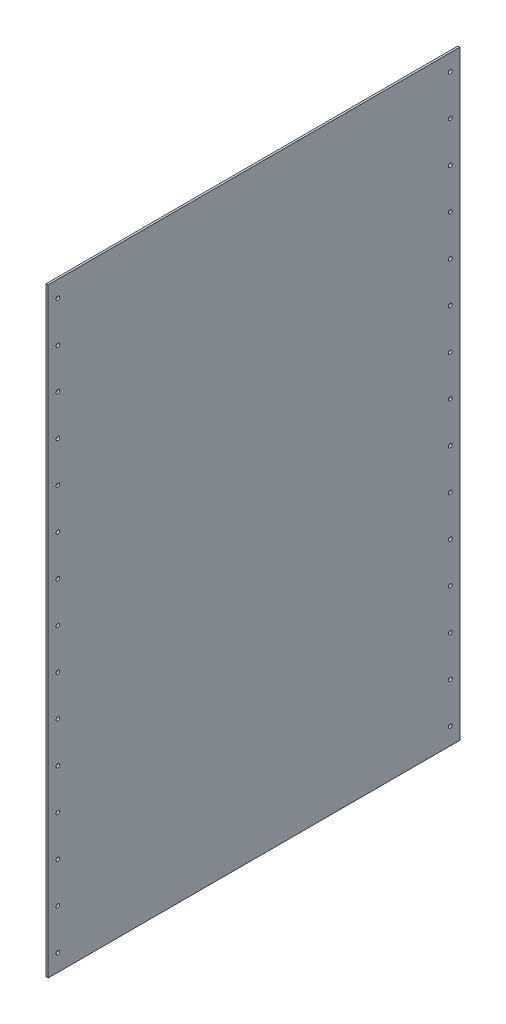
ISO-10303-21;
HEADER;
FILE_DESCRIPTION(('STEP AP214'),'2;1');
FILE_NAME('part.step','',(''),(''),'','','');
FILE_SCHEMA(('AUTOMOTIVE_DESIGN { 1 0 10303 214 1 1 1 1 }'));
ENDSEC;
DATA;
#1=APPLICATION_CONTEXT('core data for automotive mechanical design processes');
#2=APPLICATION_PROTOCOL_DEFINITION('international standard','automotive_design',2000,#1);
#3=PRODUCT_CONTEXT('',#1,'mechanical');
#4=PRODUCT('Part','Part','',(#3));
#5=PRODUCT_RELATED_PRODUCT_CATEGORY('part','',(#4));
#6=PRODUCT_DEFINITION_FORMATION('','',#4);
#7=PRODUCT_DEFINITION_CONTEXT('part definition',#1,'design');
#8=PRODUCT_DEFINITION('design','',#6,#7);
#9=PRODUCT_DEFINITION_SHAPE('','',#8);
#10=(LENGTH_UNIT() NAMED_UNIT(*) SI_UNIT(.MILLI.,.METRE.));
#11=(NAMED_UNIT(*) PLANE_ANGLE_UNIT() SI_UNIT($,.RADIAN.));
#12=(NAMED_UNIT(*) SI_UNIT($,.STERADIAN.) SOLID_ANGLE_UNIT());
#13=UNCERTAINTY_MEASURE_WITH_UNIT(LENGTH_MEASURE(1.E-05),#10,'distance_accuracy_value','');
#14=(GEOMETRIC_REPRESENTATION_CONTEXT(3) GLOBAL_UNCERTAINTY_ASSIGNED_CONTEXT((#13)) GLOBAL_UNIT_ASSIGNED_CONTEXT((#10,
#11,#12)) REPRESENTATION_CONTEXT('',''));
#15=CARTESIAN_POINT('',(0.,0.,0.));
#16=DIRECTION('',(0.,0.,1.));
#17=DIRECTION('',(1.,0.,0.));
#18=AXIS2_PLACEMENT_3D('',#15,#16,#17);
#19=CARTESIAN_POINT('',(3.,0.,0.));
#20=DIRECTION('',(0.,0.,-1.));
#21=DIRECTION('',(-1.,0.,0.));
#22=AXIS2_PLACEMENT_3D('',#19,#20,#21);
#23=PLANE('',#22);
#24=DIRECTION('',(0.,-1.,0.));
#25=VECTOR('',#24,1.);
#26=CARTESIAN_POINT('',(0.,0.,0.));
#27=LINE('',#26,#25);
#28=CARTESIAN_POINT('',(0.,889.,0.));
#29=VERTEX_POINT('',#28);
#30=CARTESIAN_POINT('',(0.,0.,0.));
#31=VERTEX_POINT('',#30);
#32=EDGE_CURVE('E100',#29,#31,#27,.T.);
#33=ORIENTED_EDGE('',*,*,#32,.T.);
#34=DIRECTION('',(-1.,0.,0.));
#35=VECTOR('',#34,1.);
#36=CARTESIAN_POINT('',(3.,0.,0.));
#37=LINE('',#36,#35);
#38=CARTESIAN_POINT('',(3.,0.,0.));
#39=VERTEX_POINT('',#38);
#40=EDGE_CURVE('E11',#39,#31,#37,.T.);
#41=ORIENTED_EDGE('',*,*,#40,.F.);
#42=DIRECTION('',(0.,-1.,0.));
#43=VECTOR('',#42,1.);
#44=CARTESIAN_POINT('',(3.,0.,0.));
#45=LINE('',#44,#43);
#46=CARTESIAN_POINT('',(3.,889.,0.));
#47=VERTEX_POINT('',#46);
#48=EDGE_CURVE('E87',#47,#39,#45,.T.);
#49=ORIENTED_EDGE('',*,*,#48,.F.);
#50=DIRECTION('',(-1.,0.,0.));
#51=VECTOR('',#50,1.);
#52=CARTESIAN_POINT('',(3.,889.,0.));
#53=LINE('',#52,#51);
#54=EDGE_CURVE('E96',#47,#29,#53,.T.);
#55=ORIENTED_EDGE('',*,*,#54,.T.);
#56=EDGE_LOOP('',(#33,#41,#49,#55));
#57=FACE_BOUND('',#56,.T.);
#58=ADVANCED_FACE('F36',(#57),#23,.F.);
#59=CARTESIAN_POINT('',(3.,0.,0.));
#60=DIRECTION('',(0.,1.,0.));
#61=DIRECTION('',(0.,0.,1.));
#62=AXIS2_PLACEMENT_3D('',#59,#60,#61);
#63=PLANE('',#62);
#64=DIRECTION('',(0.,0.,-1.));
#65=VECTOR('',#64,1.);
#66=CARTESIAN_POINT('',(0.,0.,0.));
#67=LINE('',#66,#65);
#68=CARTESIAN_POINT('',(0.,0.,-609.6));
#69=VERTEX_POINT('',#68);
#70=EDGE_CURVE('E92',#31,#69,#67,.T.);
#71=ORIENTED_EDGE('',*,*,#70,.T.);
#72=DIRECTION('',(-1.,0.,0.));
#73=VECTOR('',#72,1.);
#74=CARTESIAN_POINT('',(3.,0.,-609.6));
#75=LINE('',#74,#73);
#76=CARTESIAN_POINT('',(3.,0.,-609.6));
#77=VERTEX_POINT('',#76);
#78=EDGE_CURVE('E44',#77,#69,#75,.T.);
#79=ORIENTED_EDGE('',*,*,#78,.F.);
#80=DIRECTION('',(0.,0.,-1.));
#81=VECTOR('',#80,1.);
#82=CARTESIAN_POINT('',(3.,0.,0.));
#83=LINE('',#82,#81);
#84=EDGE_CURVE('E82',#39,#77,#83,.T.);
#85=ORIENTED_EDGE('',*,*,#84,.F.);
#86=ORIENTED_EDGE('',*,*,#40,.T.);
#87=EDGE_LOOP('',(#71,#79,#85,#86));
#88=FACE_BOUND('',#87,.T.);
#89=ADVANCED_FACE('F91',(#88),#63,.F.);
#90=CARTESIAN_POINT('',(3.,0.,-609.6));
#91=DIRECTION('',(0.,0.,1.));
#92=DIRECTION('',(1.,0.,0.));
#93=AXIS2_PLACEMENT_3D('',#90,#91,#92);
#94=PLANE('',#93);
#95=DIRECTION('',(0.,1.,0.));
#96=VECTOR('',#95,1.);
#97=CARTESIAN_POINT('',(0.,0.,-609.6));
#98=LINE('',#97,#96);
#99=CARTESIAN_POINT('',(0.,889.,-609.6));
#100=VERTEX_POINT('',#99);
#101=EDGE_CURVE('E69',#69,#100,#98,.T.);
#102=ORIENTED_EDGE('',*,*,#101,.T.);
#103=DIRECTION('',(-1.,0.,0.));
#104=VECTOR('',#103,1.);
#105=CARTESIAN_POINT('',(3.,889.,-609.6));
#106=LINE('',#105,#104);
#107=CARTESIAN_POINT('',(3.,889.,-609.6));
#108=VERTEX_POINT('',#107);
#109=EDGE_CURVE('E93',#108,#100,#106,.T.);
#110=ORIENTED_EDGE('',*,*,#109,.F.);
#111=DIRECTION('',(0.,1.,0.));
#112=VECTOR('',#111,1.);
#113=CARTESIAN_POINT('',(3.,0.,-609.6));
#114=LINE('',#113,#112);
#115=EDGE_CURVE('E85',#77,#108,#114,.T.);
#116=ORIENTED_EDGE('',*,*,#115,.F.);
#117=ORIENTED_EDGE('',*,*,#78,.T.);
#118=EDGE_LOOP('',(#102,#110,#116,#117));
#119=FACE_BOUND('',#118,.T.);
#120=ADVANCED_FACE('F94',(#119),#94,.F.);
#121=CARTESIAN_POINT('',(3.,889.,0.));
#122=DIRECTION('',(0.,-1.,0.));
#123=DIRECTION('',(0.,0.,-1.));
#124=AXIS2_PLACEMENT_3D('',#121,#122,#123);
#125=PLANE('',#124);
#126=DIRECTION('',(0.,0.,1.));
#127=VECTOR('',#126,1.);
#128=CARTESIAN_POINT('',(0.,889.,0.));
#129=LINE('',#128,#127);
#130=EDGE_CURVE('E75',#100,#29,#129,.T.);
#131=ORIENTED_EDGE('',*,*,#130,.T.);
#132=ORIENTED_EDGE('',*,*,#54,.F.);
#133=DIRECTION('',(0.,0.,1.));
#134=VECTOR('',#133,1.);
#135=CARTESIAN_POINT('',(3.,889.,0.));
#136=LINE('',#135,#134);
#137=EDGE_CURVE('E52',#108,#47,#136,.T.);
#138=ORIENTED_EDGE('',*,*,#137,.F.);
#139=ORIENTED_EDGE('',*,*,#109,.T.);
#140=EDGE_LOOP('',(#131,#132,#138,#139));
#141=FACE_BOUND('',#140,.T.);
#142=ADVANCED_FACE('F109',(#141),#125,.F.);
#143=CARTESIAN_POINT('',(3.,0.,0.));
#144=DIRECTION('',(-1.,0.,0.));
#145=DIRECTION('',(0.,0.,1.));
#146=AXIS2_PLACEMENT_3D('',#143,#144,#145);
#147=PLANE('',#146);
#148=CARTESIAN_POINT('',(3.,504.952,-595.312499999998));
#149=DIRECTION('',(1.,0.,0.));
#150=DIRECTION('',(0.,0.,-1.));
#151=AXIS2_PLACEMENT_3D('',#148,#149,#150);
#152=CIRCLE('',#151,2.66700000000002);
#153=CARTESIAN_POINT('',(3.,504.952,-597.979499999998));
#154=VERTEX_POINT('',#153);
#155=EDGE_CURVE('E125',#154,#154,#152,.T.);
#156=ORIENTED_EDGE('',*,*,#155,.F.);
#157=EDGE_LOOP('',(#156));
#158=FACE_BOUND('',#157,.T.);
#159=CARTESIAN_POINT('',(3.,564.896,-595.312499999998));
#160=DIRECTION('',(1.,0.,0.));
#161=DIRECTION('',(0.,0.,-1.));
#162=AXIS2_PLACEMENT_3D('',#159,#160,#161);
#163=CIRCLE('',#162,2.66700000000002);
#164=CARTESIAN_POINT('',(3.,564.896,-597.979499999998));
#165=VERTEX_POINT('',#164);
#166=EDGE_CURVE('E185',#165,#165,#163,.T.);
#167=ORIENTED_EDGE('',*,*,#166,.F.);
#168=EDGE_LOOP('',(#167));
#169=FACE_BOUND('',#168,.T.);
#170=CARTESIAN_POINT('',(3.,624.839999999999,-595.312499999998));
#171=DIRECTION('',(1.,0.,0.));
#172=DIRECTION('',(0.,0.,-1.));
#173=AXIS2_PLACEMENT_3D('',#170,#171,#172);
#174=CIRCLE('',#173,2.66700000000002);
#175=CARTESIAN_POINT('',(3.,624.839999999999,-597.979499999998));
#176=VERTEX_POINT('',#175);
#177=EDGE_CURVE('E179',#176,#176,#174,.T.);
#178=ORIENTED_EDGE('',*,*,#177,.F.);
#179=EDGE_LOOP('',(#178));
#180=FACE_BOUND('',#179,.T.);
#181=CARTESIAN_POINT('',(3.,684.784,-595.312499999998));
#182=DIRECTION('',(1.,0.,0.));
#183=DIRECTION('',(0.,0.,-1.));
#184=AXIS2_PLACEMENT_3D('',#181,#182,#183);
#185=CIRCLE('',#184,2.66700000000002);
#186=CARTESIAN_POINT('',(3.,684.784,-597.979499999998));
#187=VERTEX_POINT('',#186);
#188=EDGE_CURVE('E172',#187,#187,#185,.T.);
#189=ORIENTED_EDGE('',*,*,#188,.F.);
#190=EDGE_LOOP('',(#189));
#191=FACE_BOUND('',#190,.T.);
#192=CARTESIAN_POINT('',(3.,85.344,-14.2874999999998));
#193=DIRECTION('',(1.,0.,0.));
#194=DIRECTION('',(0.,0.,-1.));
#195=AXIS2_PLACEMENT_3D('',#192,#193,#194);
#196=CIRCLE('',#195,2.66699999999999);
#197=CARTESIAN_POINT('',(3.,85.344,-16.9544999999998));
#198=VERTEX_POINT('',#197);
#199=EDGE_CURVE('E208',#198,#198,#196,.T.);
#200=ORIENTED_EDGE('',*,*,#199,.F.);
#201=EDGE_LOOP('',(#200));
#202=FACE_BOUND('',#201,.T.);
#203=CARTESIAN_POINT('',(3.,864.615999999999,-595.312499999997));
#204=DIRECTION('',(1.,0.,0.));
#205=DIRECTION('',(0.,0.,-1.));
#206=AXIS2_PLACEMENT_3D('',#203,#204,#205);
#207=CIRCLE('',#206,2.66700000000002);
#208=CARTESIAN_POINT('',(3.,864.615999999999,-597.979499999997));
#209=VERTEX_POINT('',#208);
#210=EDGE_CURVE('E197',#209,#209,#207,.T.);
#211=ORIENTED_EDGE('',*,*,#210,.F.);
#212=EDGE_LOOP('',(#211));
#213=FACE_BOUND('',#212,.T.);
#214=CARTESIAN_POINT('',(3.,804.671999999999,-595.312499999997));
#215=DIRECTION('',(1.,0.,0.));
#216=DIRECTION('',(0.,0.,-1.));
#217=AXIS2_PLACEMENT_3D('',#214,#215,#216);
#218=CIRCLE('',#217,2.66700000000002);
#219=CARTESIAN_POINT('',(3.,804.671999999999,-597.979499999997));
#220=VERTEX_POINT('',#219);
#221=EDGE_CURVE('E196',#220,#220,#218,.T.);
#222=ORIENTED_EDGE('',*,*,#221,.F.);
#223=EDGE_LOOP('',(#222));
#224=FACE_BOUND('',#223,.T.);
#225=CARTESIAN_POINT('',(3.,744.727999999999,-595.312499999997));
#226=DIRECTION('',(1.,0.,0.));
#227=DIRECTION('',(0.,0.,-1.));
#228=AXIS2_PLACEMENT_3D('',#225,#226,#227);
#229=CIRCLE('',#228,2.66700000000002);
#230=CARTESIAN_POINT('',(3.,744.727999999999,-597.979499999997));
#231=VERTEX_POINT('',#230);
#232=EDGE_CURVE('E173',#231,#231,#229,.T.);
#233=ORIENTED_EDGE('',*,*,#232,.F.);
#234=EDGE_LOOP('',(#233));
#235=FACE_BOUND('',#234,.T.);
#236=CARTESIAN_POINT('',(3.,445.008,-595.312499999999));
#237=DIRECTION('',(1.,0.,0.));
#238=DIRECTION('',(0.,0.,-1.));
#239=AXIS2_PLACEMENT_3D('',#236,#237,#238);
#240=CIRCLE('',#239,2.66700000000002);
#241=CARTESIAN_POINT('',(3.,445.008,-597.979499999999));
#242=VERTEX_POINT('',#241);
#243=EDGE_CURVE('E124',#242,#242,#240,.T.);
#244=ORIENTED_EDGE('',*,*,#243,.F.);
#245=EDGE_LOOP('',(#244));
#246=FACE_BOUND('',#245,.T.);
#247=CARTESIAN_POINT('',(3.,385.064,-595.312499999999));
#248=DIRECTION('',(1.,0.,0.));
#249=DIRECTION('',(0.,0.,-1.));
#250=AXIS2_PLACEMENT_3D('',#247,#248,#249);
#251=CIRCLE('',#250,2.66700000000002);
#252=CARTESIAN_POINT('',(3.,385.064,-597.979499999999));
#253=VERTEX_POINT('',#252);
#254=EDGE_CURVE('E131',#253,#253,#251,.T.);
#255=ORIENTED_EDGE('',*,*,#254,.F.);
#256=EDGE_LOOP('',(#255));
#257=FACE_BOUND('',#256,.T.);
#258=CARTESIAN_POINT('',(3.,325.12,-595.312499999999));
#259=DIRECTION('',(1.,0.,0.));
#260=DIRECTION('',(0.,0.,-1.));
#261=AXIS2_PLACEMENT_3D('',#258,#259,#260);
#262=CIRCLE('',#261,2.66700000000002);
#263=CARTESIAN_POINT('',(3.,325.12,-597.979499999999));
#264=VERTEX_POINT('',#263);
#265=EDGE_CURVE('E137',#264,#264,#262,.T.);
#266=ORIENTED_EDGE('',*,*,#265,.F.);
#267=EDGE_LOOP('',(#266));
#268=FACE_BOUND('',#267,.T.);
#269=CARTESIAN_POINT('',(3.,265.176,-595.312499999999));
#270=DIRECTION('',(1.,0.,0.));
#271=DIRECTION('',(0.,0.,-1.));
#272=AXIS2_PLACEMENT_3D('',#269,#270,#271);
#273=CIRCLE('',#272,2.66700000000002);
#274=CARTESIAN_POINT('',(3.,265.176,-597.979499999999));
#275=VERTEX_POINT('',#274);
#276=EDGE_CURVE('E143',#275,#275,#273,.T.);
#277=ORIENTED_EDGE('',*,*,#276,.F.);
#278=EDGE_LOOP('',(#277));
#279=FACE_BOUND('',#278,.T.);
#280=CARTESIAN_POINT('',(3.,205.232,-595.312499999999));
#281=DIRECTION('',(1.,0.,0.));
#282=DIRECTION('',(0.,0.,-1.));
#283=AXIS2_PLACEMENT_3D('',#280,#281,#282);
#284=CIRCLE('',#283,2.66700000000002);
#285=CARTESIAN_POINT('',(3.,205.232,-597.979499999999));
#286=VERTEX_POINT('',#285);
#287=EDGE_CURVE('E149',#286,#286,#284,.T.);
#288=ORIENTED_EDGE('',*,*,#287,.F.);
#289=EDGE_LOOP('',(#288));
#290=FACE_BOUND('',#289,.T.);
#291=CARTESIAN_POINT('',(3.,145.288,-595.3125));
#292=DIRECTION('',(1.,0.,0.));
#293=DIRECTION('',(0.,0.,-1.));
#294=AXIS2_PLACEMENT_3D('',#291,#292,#293);
#295=CIRCLE('',#294,2.66700000000002);
#296=CARTESIAN_POINT('',(3.,145.288,-597.9795));
#297=VERTEX_POINT('',#296);
#298=EDGE_CURVE('E155',#297,#297,#295,.T.);
#299=ORIENTED_EDGE('',*,*,#298,.F.);
#300=EDGE_LOOP('',(#299));
#301=FACE_BOUND('',#300,.T.);
#302=CARTESIAN_POINT('',(3.,85.344,-595.3125));
#303=DIRECTION('',(1.,0.,0.));
#304=DIRECTION('',(0.,0.,-1.));
#305=AXIS2_PLACEMENT_3D('',#302,#303,#304);
#306=CIRCLE('',#305,2.66700000000002);
#307=CARTESIAN_POINT('',(3.,85.344,-597.9795));
#308=VERTEX_POINT('',#307);
#309=EDGE_CURVE('E161',#308,#308,#306,.T.);
#310=ORIENTED_EDGE('',*,*,#309,.F.);
#311=EDGE_LOOP('',(#310));
#312=FACE_BOUND('',#311,.T.);
#313=CARTESIAN_POINT('',(3.,25.4,-595.3125));
#314=DIRECTION('',(1.,0.,0.));
#315=DIRECTION('',(0.,0.,-1.));
#316=AXIS2_PLACEMENT_3D('',#313,#314,#315);
#317=CIRCLE('',#316,2.66700000000002);
#318=CARTESIAN_POINT('',(3.,25.4,-597.9795));
#319=VERTEX_POINT('',#318);
#320=EDGE_CURVE('E118',#319,#319,#317,.T.);
#321=ORIENTED_EDGE('',*,*,#320,.F.);
#322=EDGE_LOOP('',(#321));
#323=FACE_BOUND('',#322,.T.);
#324=CARTESIAN_POINT('',(3.,145.288,-14.2874999999996));
#325=DIRECTION('',(1.,0.,0.));
#326=DIRECTION('',(0.,0.,-1.));
#327=AXIS2_PLACEMENT_3D('',#324,#325,#326);
#328=CIRCLE('',#327,2.66700000000001);
#329=CARTESIAN_POINT('',(3.,145.288,-16.9544999999996));
#330=VERTEX_POINT('',#329);
#331=EDGE_CURVE('E209',#330,#330,#328,.T.);
#332=ORIENTED_EDGE('',*,*,#331,.F.);
#333=EDGE_LOOP('',(#332));
#334=FACE_BOUND('',#333,.T.);
#335=CARTESIAN_POINT('',(3.,205.232,-14.2874999999994));
#336=DIRECTION('',(1.,0.,0.));
#337=DIRECTION('',(0.,0.,-1.));
#338=AXIS2_PLACEMENT_3D('',#335,#336,#337);
#339=CIRCLE('',#338,2.66700000000001);
#340=CARTESIAN_POINT('',(3.,205.232,-16.9544999999994));
#341=VERTEX_POINT('',#340);
#342=EDGE_CURVE('E286',#341,#341,#339,.T.);
#343=ORIENTED_EDGE('',*,*,#342,.F.);
#344=EDGE_LOOP('',(#343));
#345=FACE_BOUND('',#344,.T.);
#346=CARTESIAN_POINT('',(3.,265.176,-14.2874999999992));
#347=DIRECTION('',(1.,0.,0.));
#348=DIRECTION('',(0.,0.,-1.));
#349=AXIS2_PLACEMENT_3D('',#346,#347,#348);
#350=CIRCLE('',#349,2.66700000000001);
#351=CARTESIAN_POINT('',(3.,265.176,-16.9544999999992));
#352=VERTEX_POINT('',#351);
#353=EDGE_CURVE('E280',#352,#352,#350,.T.);
#354=ORIENTED_EDGE('',*,*,#353,.F.);
#355=EDGE_LOOP('',(#354));
#356=FACE_BOUND('',#355,.T.);
#357=CARTESIAN_POINT('',(3.,325.12,-14.287499999999));
#358=DIRECTION('',(1.,0.,0.));
#359=DIRECTION('',(0.,0.,-1.));
#360=AXIS2_PLACEMENT_3D('',#357,#358,#359);
#361=CIRCLE('',#360,2.66700000000001);
#362=CARTESIAN_POINT('',(3.,325.12,-16.954499999999));
#363=VERTEX_POINT('',#362);
#364=EDGE_CURVE('E274',#363,#363,#361,.T.);
#365=ORIENTED_EDGE('',*,*,#364,.F.);
#366=EDGE_LOOP('',(#365));
#367=FACE_BOUND('',#366,.T.);
#368=CARTESIAN_POINT('',(3.,385.064,-14.2874999999988));
#369=DIRECTION('',(1.,0.,0.));
#370=DIRECTION('',(0.,0.,-1.));
#371=AXIS2_PLACEMENT_3D('',#368,#369,#370);
#372=CIRCLE('',#371,2.66700000000001);
#373=CARTESIAN_POINT('',(3.,385.064,-16.9544999999988));
#374=VERTEX_POINT('',#373);
#375=EDGE_CURVE('E268',#374,#374,#372,.T.);
#376=ORIENTED_EDGE('',*,*,#375,.F.);
#377=EDGE_LOOP('',(#376));
#378=FACE_BOUND('',#377,.T.);
#379=CARTESIAN_POINT('',(3.,445.008,-14.2874999999985));
#380=DIRECTION('',(1.,0.,0.));
#381=DIRECTION('',(0.,0.,-1.));
#382=AXIS2_PLACEMENT_3D('',#379,#380,#381);
#383=CIRCLE('',#382,2.66700000000001);
#384=CARTESIAN_POINT('',(3.,445.008,-16.9544999999985));
#385=VERTEX_POINT('',#384);
#386=EDGE_CURVE('E262',#385,#385,#383,.T.);
#387=ORIENTED_EDGE('',*,*,#386,.F.);
#388=EDGE_LOOP('',(#387));
#389=FACE_BOUND('',#388,.T.);
#390=CARTESIAN_POINT('',(3.,504.952,-14.2874999999983));
#391=DIRECTION('',(1.,0.,0.));
#392=DIRECTION('',(0.,0.,-1.));
#393=AXIS2_PLACEMENT_3D('',#390,#391,#392);
#394=CIRCLE('',#393,2.66700000000001);
#395=CARTESIAN_POINT('',(3.,504.952,-16.9544999999983));
#396=VERTEX_POINT('',#395);
#397=EDGE_CURVE('E256',#396,#396,#394,.T.);
#398=ORIENTED_EDGE('',*,*,#397,.F.);
#399=EDGE_LOOP('',(#398));
#400=FACE_BOUND('',#399,.T.);
#401=CARTESIAN_POINT('',(3.,564.896,-14.2874999999981));
#402=DIRECTION('',(1.,0.,0.));
#403=DIRECTION('',(0.,0.,-1.));
#404=AXIS2_PLACEMENT_3D('',#401,#402,#403);
#405=CIRCLE('',#404,2.66700000000001);
#406=CARTESIAN_POINT('',(3.,564.896,-16.9544999999981));
#407=VERTEX_POINT('',#406);
#408=EDGE_CURVE('E250',#407,#407,#405,.T.);
#409=ORIENTED_EDGE('',*,*,#408,.F.);
#410=EDGE_LOOP('',(#409));
#411=FACE_BOUND('',#410,.T.);
#412=CARTESIAN_POINT('',(3.,624.839999999999,-14.2874999999979));
#413=DIRECTION('',(1.,0.,0.));
#414=DIRECTION('',(0.,0.,-1.));
#415=AXIS2_PLACEMENT_3D('',#412,#413,#414);
#416=CIRCLE('',#415,2.66700000000001);
#417=CARTESIAN_POINT('',(3.,624.839999999999,-16.9544999999979));
#418=VERTEX_POINT('',#417);
#419=EDGE_CURVE('E244',#418,#418,#416,.T.);
#420=ORIENTED_EDGE('',*,*,#419,.F.);
#421=EDGE_LOOP('',(#420));
#422=FACE_BOUND('',#421,.T.);
#423=CARTESIAN_POINT('',(3.,684.784,-14.2874999999977));
#424=DIRECTION('',(1.,0.,0.));
#425=DIRECTION('',(0.,0.,-1.));
#426=AXIS2_PLACEMENT_3D('',#423,#424,#425);
#427=CIRCLE('',#426,2.66700000000001);
#428=CARTESIAN_POINT('',(3.,684.784,-16.9544999999977));
#429=VERTEX_POINT('',#428);
#430=EDGE_CURVE('E238',#429,#429,#427,.T.);
#431=ORIENTED_EDGE('',*,*,#430,.F.);
#432=EDGE_LOOP('',(#431));
#433=FACE_BOUND('',#432,.T.);
#434=CARTESIAN_POINT('',(3.,744.727999999999,-14.2874999999975));
#435=DIRECTION('',(1.,0.,0.));
#436=DIRECTION('',(0.,0.,-1.));
#437=AXIS2_PLACEMENT_3D('',#434,#435,#436);
#438=CIRCLE('',#437,2.66700000000001);
#439=CARTESIAN_POINT('',(3.,744.727999999999,-16.9544999999975));
#440=VERTEX_POINT('',#439);
#441=EDGE_CURVE('E232',#440,#440,#438,.T.);
#442=ORIENTED_EDGE('',*,*,#441,.F.);
#443=EDGE_LOOP('',(#442));
#444=FACE_BOUND('',#443,.T.);
#445=CARTESIAN_POINT('',(3.,804.671999999999,-14.2874999999973));
#446=DIRECTION('',(1.,0.,0.));
#447=DIRECTION('',(0.,0.,-1.));
#448=AXIS2_PLACEMENT_3D('',#445,#446,#447);
#449=CIRCLE('',#448,2.66700000000001);
#450=CARTESIAN_POINT('',(3.,804.671999999999,-16.9544999999973));
#451=VERTEX_POINT('',#450);
#452=EDGE_CURVE('E226',#451,#451,#449,.T.);
#453=ORIENTED_EDGE('',*,*,#452,.F.);
#454=EDGE_LOOP('',(#453));
#455=FACE_BOUND('',#454,.T.);
#456=CARTESIAN_POINT('',(3.,864.615999999999,-14.2874999999971));
#457=DIRECTION('',(1.,0.,0.));
#458=DIRECTION('',(0.,0.,-1.));
#459=AXIS2_PLACEMENT_3D('',#456,#457,#458);
#460=CIRCLE('',#459,2.66700000000001);
#461=CARTESIAN_POINT('',(3.,864.615999999999,-16.9544999999971));
#462=VERTEX_POINT('',#461);
#463=EDGE_CURVE('E220',#462,#462,#460,.T.);
#464=ORIENTED_EDGE('',*,*,#463,.F.);
#465=EDGE_LOOP('',(#464));
#466=FACE_BOUND('',#465,.T.);
#467=CARTESIAN_POINT('',(3.,25.4,-14.2875));
#468=DIRECTION('',(1.,0.,0.));
#469=DIRECTION('',(0.,0.,-1.));
#470=AXIS2_PLACEMENT_3D('',#467,#468,#469);
#471=CIRCLE('',#470,2.667);
#472=CARTESIAN_POINT('',(3.,25.4,-16.9545));
#473=VERTEX_POINT('',#472);
#474=EDGE_CURVE('E103',#473,#473,#471,.T.);
#475=ORIENTED_EDGE('',*,*,#474,.F.);
#476=EDGE_LOOP('',(#475));
#477=FACE_BOUND('',#476,.T.);
#478=ORIENTED_EDGE('',*,*,#48,.T.);
#479=ORIENTED_EDGE('',*,*,#84,.T.);
#480=ORIENTED_EDGE('',*,*,#115,.T.);
#481=ORIENTED_EDGE('',*,*,#137,.T.);
#482=EDGE_LOOP('',(#478,#479,#480,#481));
#483=FACE_BOUND('',#482,.T.);
#484=ADVANCED_FACE('F83',(#158,#169,#180,#191,#202,#213,#224,#235,#246,#257,#268,#279,#290,#301,
#312,#323,#334,#345,#356,#367,#378,#389,#400,#411,#422,#433,#444,#455,#466,#477,#483),#147,.F.);
#485=CARTESIAN_POINT('',(0.,0.,0.));
#486=DIRECTION('',(-1.,0.,0.));
#487=DIRECTION('',(0.,0.,1.));
#488=AXIS2_PLACEMENT_3D('',#485,#486,#487);
#489=PLANE('',#488);
#490=CARTESIAN_POINT('',(0.,504.952,-595.312499999998));
#491=DIRECTION('',(-1.,0.,0.));
#492=DIRECTION('',(0.,0.,1.));
#493=AXIS2_PLACEMENT_3D('',#490,#491,#492);
#494=CIRCLE('',#493,2.66700000000002);
#495=CARTESIAN_POINT('',(0.,504.952,-592.645499999998));
#496=VERTEX_POINT('',#495);
#497=EDGE_CURVE('E188',#496,#496,#494,.F.);
#498=ORIENTED_EDGE('',*,*,#497,.T.);
#499=EDGE_LOOP('',(#498));
#500=FACE_BOUND('',#499,.T.);
#501=CARTESIAN_POINT('',(0.,564.896,-595.312499999998));
#502=DIRECTION('',(-1.,0.,0.));
#503=DIRECTION('',(0.,0.,1.));
#504=AXIS2_PLACEMENT_3D('',#501,#502,#503);
#505=CIRCLE('',#504,2.66700000000002);
#506=CARTESIAN_POINT('',(0.,564.896,-592.645499999998));
#507=VERTEX_POINT('',#506);
#508=EDGE_CURVE('E182',#507,#507,#505,.F.);
#509=ORIENTED_EDGE('',*,*,#508,.T.);
#510=EDGE_LOOP('',(#509));
#511=FACE_BOUND('',#510,.T.);
#512=CARTESIAN_POINT('',(0.,624.839999999999,-595.312499999998));
#513=DIRECTION('',(-1.,0.,0.));
#514=DIRECTION('',(0.,0.,1.));
#515=AXIS2_PLACEMENT_3D('',#512,#513,#514);
#516=CIRCLE('',#515,2.66700000000002);
#517=CARTESIAN_POINT('',(0.,624.839999999999,-592.645499999998));
#518=VERTEX_POINT('',#517);
#519=EDGE_CURVE('E176',#518,#518,#516,.F.);
#520=ORIENTED_EDGE('',*,*,#519,.T.);
#521=EDGE_LOOP('',(#520));
#522=FACE_BOUND('',#521,.T.);
#523=CARTESIAN_POINT('',(0.,684.784,-595.312499999998));
#524=DIRECTION('',(-1.,0.,0.));
#525=DIRECTION('',(0.,0.,1.));
#526=AXIS2_PLACEMENT_3D('',#523,#524,#525);
#527=CIRCLE('',#526,2.66700000000002);
#528=CARTESIAN_POINT('',(0.,684.784,-592.645499999998));
#529=VERTEX_POINT('',#528);
#530=EDGE_CURVE('E169',#529,#529,#527,.F.);
#531=ORIENTED_EDGE('',*,*,#530,.T.);
#532=EDGE_LOOP('',(#531));
#533=FACE_BOUND('',#532,.T.);
#534=CARTESIAN_POINT('',(0.,85.344,-14.2874999999998));
#535=DIRECTION('',(-1.,0.,0.));
#536=DIRECTION('',(0.,0.,1.));
#537=AXIS2_PLACEMENT_3D('',#534,#535,#536);
#538=CIRCLE('',#537,2.66699999999999);
#539=CARTESIAN_POINT('',(0.,85.344,-11.6204999999998));
#540=VERTEX_POINT('',#539);
#541=EDGE_CURVE('E205',#540,#540,#538,.F.);
#542=ORIENTED_EDGE('',*,*,#541,.T.);
#543=EDGE_LOOP('',(#542));
#544=FACE_BOUND('',#543,.T.);
#545=CARTESIAN_POINT('',(0.,864.615999999999,-595.312499999997));
#546=DIRECTION('',(-1.,0.,0.));
#547=DIRECTION('',(0.,0.,1.));
#548=AXIS2_PLACEMENT_3D('',#545,#546,#547);
#549=CIRCLE('',#548,2.66700000000002);
#550=CARTESIAN_POINT('',(0.,864.615999999999,-592.645499999997));
#551=VERTEX_POINT('',#550);
#552=EDGE_CURVE('E212',#551,#551,#549,.F.);
#553=ORIENTED_EDGE('',*,*,#552,.T.);
#554=EDGE_LOOP('',(#553));
#555=FACE_BOUND('',#554,.T.);
#556=CARTESIAN_POINT('',(0.,804.671999999999,-595.312499999997));
#557=DIRECTION('',(-1.,0.,0.));
#558=DIRECTION('',(0.,0.,1.));
#559=AXIS2_PLACEMENT_3D('',#556,#557,#558);
#560=CIRCLE('',#559,2.66700000000002);
#561=CARTESIAN_POINT('',(0.,804.671999999999,-592.645499999997));
#562=VERTEX_POINT('',#561);
#563=EDGE_CURVE('E193',#562,#562,#560,.F.);
#564=ORIENTED_EDGE('',*,*,#563,.T.);
#565=EDGE_LOOP('',(#564));
#566=FACE_BOUND('',#565,.T.);
#567=CARTESIAN_POINT('',(0.,744.727999999999,-595.312499999997));
#568=DIRECTION('',(-1.,0.,0.));
#569=DIRECTION('',(0.,0.,1.));
#570=AXIS2_PLACEMENT_3D('',#567,#568,#569);
#571=CIRCLE('',#570,2.66700000000002);
#572=CARTESIAN_POINT('',(0.,744.727999999999,-592.645499999997));
#573=VERTEX_POINT('',#572);
#574=EDGE_CURVE('E200',#573,#573,#571,.F.);
#575=ORIENTED_EDGE('',*,*,#574,.T.);
#576=EDGE_LOOP('',(#575));
#577=FACE_BOUND('',#576,.T.);
#578=CARTESIAN_POINT('',(0.,445.008,-595.312499999999));
#579=DIRECTION('',(-1.,0.,0.));
#580=DIRECTION('',(0.,0.,1.));
#581=AXIS2_PLACEMENT_3D('',#578,#579,#580);
#582=CIRCLE('',#581,2.66700000000002);
#583=CARTESIAN_POINT('',(0.,445.008,-592.645499999999));
#584=VERTEX_POINT('',#583);
#585=EDGE_CURVE('E121',#584,#584,#582,.F.);
#586=ORIENTED_EDGE('',*,*,#585,.T.);
#587=EDGE_LOOP('',(#586));
#588=FACE_BOUND('',#587,.T.);
#589=CARTESIAN_POINT('',(0.,385.064,-595.312499999999));
#590=DIRECTION('',(-1.,0.,0.));
#591=DIRECTION('',(0.,0.,1.));
#592=AXIS2_PLACEMENT_3D('',#589,#590,#591);
#593=CIRCLE('',#592,2.66700000000002);
#594=CARTESIAN_POINT('',(0.,385.064,-592.645499999999));
#595=VERTEX_POINT('',#594);
#596=EDGE_CURVE('E128',#595,#595,#593,.F.);
#597=ORIENTED_EDGE('',*,*,#596,.T.);
#598=EDGE_LOOP('',(#597));
#599=FACE_BOUND('',#598,.T.);
#600=CARTESIAN_POINT('',(0.,325.12,-595.312499999999));
#601=DIRECTION('',(-1.,0.,0.));
#602=DIRECTION('',(0.,0.,1.));
#603=AXIS2_PLACEMENT_3D('',#600,#601,#602);
#604=CIRCLE('',#603,2.66700000000002);
#605=CARTESIAN_POINT('',(0.,325.12,-592.645499999999));
#606=VERTEX_POINT('',#605);
#607=EDGE_CURVE('E134',#606,#606,#604,.F.);
#608=ORIENTED_EDGE('',*,*,#607,.T.);
#609=EDGE_LOOP('',(#608));
#610=FACE_BOUND('',#609,.T.);
#611=CARTESIAN_POINT('',(0.,265.176,-595.312499999999));
#612=DIRECTION('',(-1.,0.,0.));
#613=DIRECTION('',(0.,0.,1.));
#614=AXIS2_PLACEMENT_3D('',#611,#612,#613);
#615=CIRCLE('',#614,2.66700000000002);
#616=CARTESIAN_POINT('',(0.,265.176,-592.645499999999));
#617=VERTEX_POINT('',#616);
#618=EDGE_CURVE('E140',#617,#617,#615,.F.);
#619=ORIENTED_EDGE('',*,*,#618,.T.);
#620=EDGE_LOOP('',(#619));
#621=FACE_BOUND('',#620,.T.);
#622=CARTESIAN_POINT('',(0.,205.232,-595.312499999999));
#623=DIRECTION('',(-1.,0.,0.));
#624=DIRECTION('',(0.,0.,1.));
#625=AXIS2_PLACEMENT_3D('',#622,#623,#624);
#626=CIRCLE('',#625,2.66700000000002);
#627=CARTESIAN_POINT('',(0.,205.232,-592.645499999999));
#628=VERTEX_POINT('',#627);
#629=EDGE_CURVE('E146',#628,#628,#626,.F.);
#630=ORIENTED_EDGE('',*,*,#629,.T.);
#631=EDGE_LOOP('',(#630));
#632=FACE_BOUND('',#631,.T.);
#633=CARTESIAN_POINT('',(0.,145.288,-595.3125));
#634=DIRECTION('',(-1.,0.,0.));
#635=DIRECTION('',(0.,0.,1.));
#636=AXIS2_PLACEMENT_3D('',#633,#634,#635);
#637=CIRCLE('',#636,2.66700000000002);
#638=CARTESIAN_POINT('',(0.,145.288,-592.6455));
#639=VERTEX_POINT('',#638);
#640=EDGE_CURVE('E152',#639,#639,#637,.F.);
#641=ORIENTED_EDGE('',*,*,#640,.T.);
#642=EDGE_LOOP('',(#641));
#643=FACE_BOUND('',#642,.T.);
#644=CARTESIAN_POINT('',(0.,85.344,-595.3125));
#645=DIRECTION('',(-1.,0.,0.));
#646=DIRECTION('',(0.,0.,1.));
#647=AXIS2_PLACEMENT_3D('',#644,#645,#646);
#648=CIRCLE('',#647,2.66700000000002);
#649=CARTESIAN_POINT('',(0.,85.344,-592.6455));
#650=VERTEX_POINT('',#649);
#651=EDGE_CURVE('E158',#650,#650,#648,.F.);
#652=ORIENTED_EDGE('',*,*,#651,.T.);
#653=EDGE_LOOP('',(#652));
#654=FACE_BOUND('',#653,.T.);
#655=CARTESIAN_POINT('',(0.,25.4,-595.3125));
#656=DIRECTION('',(-1.,0.,0.));
#657=DIRECTION('',(0.,0.,1.));
#658=AXIS2_PLACEMENT_3D('',#655,#656,#657);
#659=CIRCLE('',#658,2.66700000000002);
#660=CARTESIAN_POINT('',(0.,25.4,-592.6455));
#661=VERTEX_POINT('',#660);
#662=EDGE_CURVE('E164',#661,#661,#659,.F.);
#663=ORIENTED_EDGE('',*,*,#662,.T.);
#664=EDGE_LOOP('',(#663));
#665=FACE_BOUND('',#664,.T.);
#666=CARTESIAN_POINT('',(0.,145.288,-14.2874999999996));
#667=DIRECTION('',(-1.,0.,0.));
#668=DIRECTION('',(0.,0.,1.));
#669=AXIS2_PLACEMENT_3D('',#666,#667,#668);
#670=CIRCLE('',#669,2.66700000000001);
#671=CARTESIAN_POINT('',(0.,145.288,-11.6204999999996));
#672=VERTEX_POINT('',#671);
#673=EDGE_CURVE('E289',#672,#672,#670,.F.);
#674=ORIENTED_EDGE('',*,*,#673,.T.);
#675=EDGE_LOOP('',(#674));
#676=FACE_BOUND('',#675,.T.);
#677=CARTESIAN_POINT('',(0.,205.232,-14.2874999999994));
#678=DIRECTION('',(-1.,0.,0.));
#679=DIRECTION('',(0.,0.,1.));
#680=AXIS2_PLACEMENT_3D('',#677,#678,#679);
#681=CIRCLE('',#680,2.66700000000001);
#682=CARTESIAN_POINT('',(0.,205.232,-11.6204999999994));
#683=VERTEX_POINT('',#682);
#684=EDGE_CURVE('E283',#683,#683,#681,.F.);
#685=ORIENTED_EDGE('',*,*,#684,.T.);
#686=EDGE_LOOP('',(#685));
#687=FACE_BOUND('',#686,.T.);
#688=CARTESIAN_POINT('',(0.,265.176,-14.2874999999992));
#689=DIRECTION('',(-1.,0.,0.));
#690=DIRECTION('',(0.,0.,1.));
#691=AXIS2_PLACEMENT_3D('',#688,#689,#690);
#692=CIRCLE('',#691,2.66700000000001);
#693=CARTESIAN_POINT('',(0.,265.176,-11.6204999999992));
#694=VERTEX_POINT('',#693);
#695=EDGE_CURVE('E277',#694,#694,#692,.F.);
#696=ORIENTED_EDGE('',*,*,#695,.T.);
#697=EDGE_LOOP('',(#696));
#698=FACE_BOUND('',#697,.T.);
#699=CARTESIAN_POINT('',(0.,325.12,-14.287499999999));
#700=DIRECTION('',(-1.,0.,0.));
#701=DIRECTION('',(0.,0.,1.));
#702=AXIS2_PLACEMENT_3D('',#699,#700,#701);
#703=CIRCLE('',#702,2.66700000000001);
#704=CARTESIAN_POINT('',(0.,325.12,-11.620499999999));
#705=VERTEX_POINT('',#704);
#706=EDGE_CURVE('E271',#705,#705,#703,.F.);
#707=ORIENTED_EDGE('',*,*,#706,.T.);
#708=EDGE_LOOP('',(#707));
#709=FACE_BOUND('',#708,.T.);
#710=CARTESIAN_POINT('',(0.,385.064,-14.2874999999988));
#711=DIRECTION('',(-1.,0.,0.));
#712=DIRECTION('',(0.,0.,1.));
#713=AXIS2_PLACEMENT_3D('',#710,#711,#712);
#714=CIRCLE('',#713,2.66700000000001);
#715=CARTESIAN_POINT('',(0.,385.064,-11.6204999999987));
#716=VERTEX_POINT('',#715);
#717=EDGE_CURVE('E265',#716,#716,#714,.F.);
#718=ORIENTED_EDGE('',*,*,#717,.T.);
#719=EDGE_LOOP('',(#718));
#720=FACE_BOUND('',#719,.T.);
#721=CARTESIAN_POINT('',(0.,445.008,-14.2874999999985));
#722=DIRECTION('',(-1.,0.,0.));
#723=DIRECTION('',(0.,0.,1.));
#724=AXIS2_PLACEMENT_3D('',#721,#722,#723);
#725=CIRCLE('',#724,2.66700000000001);
#726=CARTESIAN_POINT('',(0.,445.008,-11.6204999999985));
#727=VERTEX_POINT('',#726);
#728=EDGE_CURVE('E259',#727,#727,#725,.F.);
#729=ORIENTED_EDGE('',*,*,#728,.T.);
#730=EDGE_LOOP('',(#729));
#731=FACE_BOUND('',#730,.T.);
#732=CARTESIAN_POINT('',(0.,504.952,-14.2874999999983));
#733=DIRECTION('',(-1.,0.,0.));
#734=DIRECTION('',(0.,0.,1.));
#735=AXIS2_PLACEMENT_3D('',#732,#733,#734);
#736=CIRCLE('',#735,2.66700000000001);
#737=CARTESIAN_POINT('',(0.,504.952,-11.6204999999983));
#738=VERTEX_POINT('',#737);
#739=EDGE_CURVE('E253',#738,#738,#736,.F.);
#740=ORIENTED_EDGE('',*,*,#739,.T.);
#741=EDGE_LOOP('',(#740));
#742=FACE_BOUND('',#741,.T.);
#743=CARTESIAN_POINT('',(0.,564.896,-14.2874999999981));
#744=DIRECTION('',(-1.,0.,0.));
#745=DIRECTION('',(0.,0.,1.));
#746=AXIS2_PLACEMENT_3D('',#743,#744,#745);
#747=CIRCLE('',#746,2.66700000000001);
#748=CARTESIAN_POINT('',(0.,564.896,-11.6204999999981));
#749=VERTEX_POINT('',#748);
#750=EDGE_CURVE('E247',#749,#749,#747,.F.);
#751=ORIENTED_EDGE('',*,*,#750,.T.);
#752=EDGE_LOOP('',(#751));
#753=FACE_BOUND('',#752,.T.);
#754=CARTESIAN_POINT('',(0.,624.839999999999,-14.2874999999979));
#755=DIRECTION('',(-1.,0.,0.));
#756=DIRECTION('',(0.,0.,1.));
#757=AXIS2_PLACEMENT_3D('',#754,#755,#756);
#758=CIRCLE('',#757,2.66700000000001);
#759=CARTESIAN_POINT('',(0.,624.839999999999,-11.6204999999979));
#760=VERTEX_POINT('',#759);
#761=EDGE_CURVE('E241',#760,#760,#758,.F.);
#762=ORIENTED_EDGE('',*,*,#761,.T.);
#763=EDGE_LOOP('',(#762));
#764=FACE_BOUND('',#763,.T.);
#765=CARTESIAN_POINT('',(0.,684.784,-14.2874999999977));
#766=DIRECTION('',(-1.,0.,0.));
#767=DIRECTION('',(0.,0.,1.));
#768=AXIS2_PLACEMENT_3D('',#765,#766,#767);
#769=CIRCLE('',#768,2.66700000000001);
#770=CARTESIAN_POINT('',(0.,684.784,-11.6204999999977));
#771=VERTEX_POINT('',#770);
#772=EDGE_CURVE('E235',#771,#771,#769,.F.);
#773=ORIENTED_EDGE('',*,*,#772,.T.);
#774=EDGE_LOOP('',(#773));
#775=FACE_BOUND('',#774,.T.);
#776=CARTESIAN_POINT('',(0.,744.727999999999,-14.2874999999975));
#777=DIRECTION('',(-1.,0.,0.));
#778=DIRECTION('',(0.,0.,1.));
#779=AXIS2_PLACEMENT_3D('',#776,#777,#778);
#780=CIRCLE('',#779,2.66700000000001);
#781=CARTESIAN_POINT('',(0.,744.727999999999,-11.6204999999975));
#782=VERTEX_POINT('',#781);
#783=EDGE_CURVE('E229',#782,#782,#780,.F.);
#784=ORIENTED_EDGE('',*,*,#783,.T.);
#785=EDGE_LOOP('',(#784));
#786=FACE_BOUND('',#785,.T.);
#787=CARTESIAN_POINT('',(0.,804.671999999999,-14.2874999999973));
#788=DIRECTION('',(-1.,0.,0.));
#789=DIRECTION('',(0.,0.,1.));
#790=AXIS2_PLACEMENT_3D('',#787,#788,#789);
#791=CIRCLE('',#790,2.66700000000001);
#792=CARTESIAN_POINT('',(0.,804.671999999999,-11.6204999999973));
#793=VERTEX_POINT('',#792);
#794=EDGE_CURVE('E223',#793,#793,#791,.F.);
#795=ORIENTED_EDGE('',*,*,#794,.T.);
#796=EDGE_LOOP('',(#795));
#797=FACE_BOUND('',#796,.T.);
#798=CARTESIAN_POINT('',(0.,864.615999999999,-14.2874999999971));
#799=DIRECTION('',(-1.,0.,0.));
#800=DIRECTION('',(0.,0.,1.));
#801=AXIS2_PLACEMENT_3D('',#798,#799,#800);
#802=CIRCLE('',#801,2.66700000000001);
#803=CARTESIAN_POINT('',(0.,864.615999999999,-11.6204999999971));
#804=VERTEX_POINT('',#803);
#805=EDGE_CURVE('E217',#804,#804,#802,.F.);
#806=ORIENTED_EDGE('',*,*,#805,.T.);
#807=EDGE_LOOP('',(#806));
#808=FACE_BOUND('',#807,.T.);
#809=CARTESIAN_POINT('',(0.,25.4,-14.2875));
#810=DIRECTION('',(-1.,0.,0.));
#811=DIRECTION('',(0.,0.,1.));
#812=AXIS2_PLACEMENT_3D('',#809,#810,#811);
#813=CIRCLE('',#812,2.667);
#814=CARTESIAN_POINT('',(0.,25.4,-11.6205));
#815=VERTEX_POINT('',#814);
#816=EDGE_CURVE('E115',#815,#815,#813,.F.);
#817=ORIENTED_EDGE('',*,*,#816,.T.);
#818=EDGE_LOOP('',(#817));
#819=FACE_BOUND('',#818,.T.);
#820=ORIENTED_EDGE('',*,*,#32,.F.);
#821=ORIENTED_EDGE('',*,*,#130,.F.);
#822=ORIENTED_EDGE('',*,*,#101,.F.);
#823=ORIENTED_EDGE('',*,*,#70,.F.);
#824=EDGE_LOOP('',(#820,#821,#822,#823));
#825=FACE_BOUND('',#824,.T.);
#826=ADVANCED_FACE('F112',(#500,#511,#522,#533,#544,#555,#566,#577,#588,#599,#610,#621,#632,
#643,#654,#665,#676,#687,#698,#709,#720,#731,#742,#753,#764,#775,#786,#797,#808,#819,#825),#489,.T.);
#827=CARTESIAN_POINT('',(-0.00100000000000013,25.4,-14.2875));
#828=DIRECTION('',(1.,0.,0.));
#829=DIRECTION('',(0.,0.,-1.));
#830=AXIS2_PLACEMENT_3D('',#827,#828,#829);
#831=CYLINDRICAL_SURFACE('',#830,2.667);
#832=ORIENTED_EDGE('',*,*,#816,.F.);
#833=EDGE_LOOP('',(#832));
#834=FACE_BOUND('',#833,.T.);
#835=ORIENTED_EDGE('',*,*,#474,.T.);
#836=EDGE_LOOP('',(#835));
#837=FACE_BOUND('',#836,.T.);
#838=ADVANCED_FACE('F327',(#834,#837),#831,.F.);
#839=CARTESIAN_POINT('',(-0.00100000000000013,864.615999999999,-14.2874999999971));
#840=DIRECTION('',(1.,0.,0.));
#841=DIRECTION('',(0.,0.,-1.));
#842=AXIS2_PLACEMENT_3D('',#839,#840,#841);
#843=CYLINDRICAL_SURFACE('',#842,2.66700000000001);
#844=ORIENTED_EDGE('',*,*,#805,.F.);
#845=EDGE_LOOP('',(#844));
#846=FACE_BOUND('',#845,.T.);
#847=ORIENTED_EDGE('',*,*,#463,.T.);
#848=EDGE_LOOP('',(#847));
#849=FACE_BOUND('',#848,.T.);
#850=ADVANCED_FACE('F329',(#846,#849),#843,.F.);
#851=CARTESIAN_POINT('',(-0.00100000000000013,804.671999999999,-14.2874999999973));
#852=DIRECTION('',(1.,0.,0.));
#853=DIRECTION('',(0.,0.,-1.));
#854=AXIS2_PLACEMENT_3D('',#851,#852,#853);
#855=CYLINDRICAL_SURFACE('',#854,2.66700000000001);
#856=ORIENTED_EDGE('',*,*,#794,.F.);
#857=EDGE_LOOP('',(#856));
#858=FACE_BOUND('',#857,.T.);
#859=ORIENTED_EDGE('',*,*,#452,.T.);
#860=EDGE_LOOP('',(#859));
#861=FACE_BOUND('',#860,.T.);
#862=ADVANCED_FACE('F336',(#858,#861),#855,.F.);
#863=CARTESIAN_POINT('',(-0.00100000000000013,744.727999999999,-14.2874999999975));
#864=DIRECTION('',(1.,0.,0.));
#865=DIRECTION('',(0.,0.,-1.));
#866=AXIS2_PLACEMENT_3D('',#863,#864,#865);
#867=CYLINDRICAL_SURFACE('',#866,2.66700000000001);
#868=ORIENTED_EDGE('',*,*,#783,.F.);
#869=EDGE_LOOP('',(#868));
#870=FACE_BOUND('',#869,.T.);
#871=ORIENTED_EDGE('',*,*,#441,.T.);
#872=EDGE_LOOP('',(#871));
#873=FACE_BOUND('',#872,.T.);
#874=ADVANCED_FACE('F386',(#870,#873),#867,.F.);
#875=CARTESIAN_POINT('',(-0.00100000000000013,684.784,-14.2874999999977));
#876=DIRECTION('',(1.,0.,0.));
#877=DIRECTION('',(0.,0.,-1.));
#878=AXIS2_PLACEMENT_3D('',#875,#876,#877);
#879=CYLINDRICAL_SURFACE('',#878,2.66700000000001);
#880=ORIENTED_EDGE('',*,*,#772,.F.);
#881=EDGE_LOOP('',(#880));
#882=FACE_BOUND('',#881,.T.);
#883=ORIENTED_EDGE('',*,*,#430,.T.);
#884=EDGE_LOOP('',(#883));
#885=FACE_BOUND('',#884,.T.);
#886=ADVANCED_FACE('F396',(#882,#885),#879,.F.);
#887=CARTESIAN_POINT('',(-0.00100000000000013,624.839999999999,-14.2874999999979));
#888=DIRECTION('',(1.,0.,0.));
#889=DIRECTION('',(0.,0.,-1.));
#890=AXIS2_PLACEMENT_3D('',#887,#888,#889);
#891=CYLINDRICAL_SURFACE('',#890,2.66700000000001);
#892=ORIENTED_EDGE('',*,*,#761,.F.);
#893=EDGE_LOOP('',(#892));
#894=FACE_BOUND('',#893,.T.);
#895=ORIENTED_EDGE('',*,*,#419,.T.);
#896=EDGE_LOOP('',(#895));
#897=FACE_BOUND('',#896,.T.);
#898=ADVANCED_FACE('F406',(#894,#897),#891,.F.);
#899=CARTESIAN_POINT('',(-0.00100000000000013,564.896,-14.2874999999981));
#900=DIRECTION('',(1.,0.,0.));
#901=DIRECTION('',(0.,0.,-1.));
#902=AXIS2_PLACEMENT_3D('',#899,#900,#901);
#903=CYLINDRICAL_SURFACE('',#902,2.66700000000001);
#904=ORIENTED_EDGE('',*,*,#750,.F.);
#905=EDGE_LOOP('',(#904));
#906=FACE_BOUND('',#905,.T.);
#907=ORIENTED_EDGE('',*,*,#408,.T.);
#908=EDGE_LOOP('',(#907));
#909=FACE_BOUND('',#908,.T.);
#910=ADVANCED_FACE('F416',(#906,#909),#903,.F.);
#911=CARTESIAN_POINT('',(-0.00100000000000013,504.952,-14.2874999999983));
#912=DIRECTION('',(1.,0.,0.));
#913=DIRECTION('',(0.,0.,-1.));
#914=AXIS2_PLACEMENT_3D('',#911,#912,#913);
#915=CYLINDRICAL_SURFACE('',#914,2.66700000000001);
#916=ORIENTED_EDGE('',*,*,#739,.F.);
#917=EDGE_LOOP('',(#916));
#918=FACE_BOUND('',#917,.T.);
#919=ORIENTED_EDGE('',*,*,#397,.T.);
#920=EDGE_LOOP('',(#919));
#921=FACE_BOUND('',#920,.T.);
#922=ADVANCED_FACE('F426',(#918,#921),#915,.F.);
#923=CARTESIAN_POINT('',(-0.00100000000000013,445.008,-14.2874999999985));
#924=DIRECTION('',(1.,0.,0.));
#925=DIRECTION('',(0.,0.,-1.));
#926=AXIS2_PLACEMENT_3D('',#923,#924,#925);
#927=CYLINDRICAL_SURFACE('',#926,2.66700000000001);
#928=ORIENTED_EDGE('',*,*,#728,.F.);
#929=EDGE_LOOP('',(#928));
#930=FACE_BOUND('',#929,.T.);
#931=ORIENTED_EDGE('',*,*,#386,.T.);
#932=EDGE_LOOP('',(#931));
#933=FACE_BOUND('',#932,.T.);
#934=ADVANCED_FACE('F436',(#930,#933),#927,.F.);
#935=CARTESIAN_POINT('',(-0.00100000000000013,385.064,-14.2874999999988));
#936=DIRECTION('',(1.,0.,0.));
#937=DIRECTION('',(0.,0.,-1.));
#938=AXIS2_PLACEMENT_3D('',#935,#936,#937);
#939=CYLINDRICAL_SURFACE('',#938,2.66700000000001);
#940=ORIENTED_EDGE('',*,*,#717,.F.);
#941=EDGE_LOOP('',(#940));
#942=FACE_BOUND('',#941,.T.);
#943=ORIENTED_EDGE('',*,*,#375,.T.);
#944=EDGE_LOOP('',(#943));
#945=FACE_BOUND('',#944,.T.);
#946=ADVANCED_FACE('F446',(#942,#945),#939,.F.);
#947=CARTESIAN_POINT('',(-0.00100000000000013,325.12,-14.287499999999));
#948=DIRECTION('',(1.,0.,0.));
#949=DIRECTION('',(0.,0.,-1.));
#950=AXIS2_PLACEMENT_3D('',#947,#948,#949);
#951=CYLINDRICAL_SURFACE('',#950,2.66700000000001);
#952=ORIENTED_EDGE('',*,*,#706,.F.);
#953=EDGE_LOOP('',(#952));
#954=FACE_BOUND('',#953,.T.);
#955=ORIENTED_EDGE('',*,*,#364,.T.);
#956=EDGE_LOOP('',(#955));
#957=FACE_BOUND('',#956,.T.);
#958=ADVANCED_FACE('F456',(#954,#957),#951,.F.);
#959=CARTESIAN_POINT('',(-0.00100000000000013,265.176,-14.2874999999992));
#960=DIRECTION('',(1.,0.,0.));
#961=DIRECTION('',(0.,0.,-1.));
#962=AXIS2_PLACEMENT_3D('',#959,#960,#961);
#963=CYLINDRICAL_SURFACE('',#962,2.66700000000001);
#964=ORIENTED_EDGE('',*,*,#695,.F.);
#965=EDGE_LOOP('',(#964));
#966=FACE_BOUND('',#965,.T.);
#967=ORIENTED_EDGE('',*,*,#353,.T.);
#968=EDGE_LOOP('',(#967));
#969=FACE_BOUND('',#968,.T.);
#970=ADVANCED_FACE('F466',(#966,#969),#963,.F.);
#971=CARTESIAN_POINT('',(-0.00100000000000013,205.232,-14.2874999999994));
#972=DIRECTION('',(1.,0.,0.));
#973=DIRECTION('',(0.,0.,-1.));
#974=AXIS2_PLACEMENT_3D('',#971,#972,#973);
#975=CYLINDRICAL_SURFACE('',#974,2.66700000000001);
#976=ORIENTED_EDGE('',*,*,#684,.F.);
#977=EDGE_LOOP('',(#976));
#978=FACE_BOUND('',#977,.T.);
#979=ORIENTED_EDGE('',*,*,#342,.T.);
#980=EDGE_LOOP('',(#979));
#981=FACE_BOUND('',#980,.T.);
#982=ADVANCED_FACE('F476',(#978,#981),#975,.F.);
#983=CARTESIAN_POINT('',(-0.00100000000000013,145.288,-14.2874999999996));
#984=DIRECTION('',(1.,0.,0.));
#985=DIRECTION('',(0.,0.,-1.));
#986=AXIS2_PLACEMENT_3D('',#983,#984,#985);
#987=CYLINDRICAL_SURFACE('',#986,2.66700000000001);
#988=ORIENTED_EDGE('',*,*,#673,.F.);
#989=EDGE_LOOP('',(#988));
#990=FACE_BOUND('',#989,.T.);
#991=ORIENTED_EDGE('',*,*,#331,.T.);
#992=EDGE_LOOP('',(#991));
#993=FACE_BOUND('',#992,.T.);
#994=ADVANCED_FACE('F295',(#990,#993),#987,.F.);
#995=CARTESIAN_POINT('',(-0.00100000000000013,25.4,-595.3125));
#996=DIRECTION('',(1.,0.,0.));
#997=DIRECTION('',(0.,0.,-1.));
#998=AXIS2_PLACEMENT_3D('',#995,#996,#997);
#999=CYLINDRICAL_SURFACE('',#998,2.66700000000002);
#1000=ORIENTED_EDGE('',*,*,#662,.F.);
#1001=EDGE_LOOP('',(#1000));
#1002=FACE_BOUND('',#1001,.T.);
#1003=ORIENTED_EDGE('',*,*,#320,.T.);
#1004=EDGE_LOOP('',(#1003));
#1005=FACE_BOUND('',#1004,.T.);
#1006=ADVANCED_FACE('F495',(#1002,#1005),#999,.F.);
#1007=CARTESIAN_POINT('',(-0.00100000000000013,85.344,-595.3125));
#1008=DIRECTION('',(1.,0.,0.));
#1009=DIRECTION('',(0.,0.,-1.));
#1010=AXIS2_PLACEMENT_3D('',#1007,#1008,#1009);
#1011=CYLINDRICAL_SURFACE('',#1010,2.66700000000002);
#1012=ORIENTED_EDGE('',*,*,#651,.F.);
#1013=EDGE_LOOP('',(#1012));
#1014=FACE_BOUND('',#1013,.T.);
#1015=ORIENTED_EDGE('',*,*,#309,.T.);
#1016=EDGE_LOOP('',(#1015));
#1017=FACE_BOUND('',#1016,.T.);
#1018=ADVANCED_FACE('F505',(#1014,#1017),#1011,.F.);
#1019=CARTESIAN_POINT('',(-0.00100000000000013,145.288,-595.3125));
#1020=DIRECTION('',(1.,0.,0.));
#1021=DIRECTION('',(0.,0.,-1.));
#1022=AXIS2_PLACEMENT_3D('',#1019,#1020,#1021);
#1023=CYLINDRICAL_SURFACE('',#1022,2.66700000000002);
#1024=ORIENTED_EDGE('',*,*,#640,.F.);
#1025=EDGE_LOOP('',(#1024));
#1026=FACE_BOUND('',#1025,.T.);
#1027=ORIENTED_EDGE('',*,*,#298,.T.);
#1028=EDGE_LOOP('',(#1027));
#1029=FACE_BOUND('',#1028,.T.);
#1030=ADVANCED_FACE('F515',(#1026,#1029),#1023,.F.);
#1031=CARTESIAN_POINT('',(-0.00100000000000013,205.232,-595.312499999999));
#1032=DIRECTION('',(1.,0.,0.));
#1033=DIRECTION('',(0.,0.,-1.));
#1034=AXIS2_PLACEMENT_3D('',#1031,#1032,#1033);
#1035=CYLINDRICAL_SURFACE('',#1034,2.66700000000002);
#1036=ORIENTED_EDGE('',*,*,#629,.F.);
#1037=EDGE_LOOP('',(#1036));
#1038=FACE_BOUND('',#1037,.T.);
#1039=ORIENTED_EDGE('',*,*,#287,.T.);
#1040=EDGE_LOOP('',(#1039));
#1041=FACE_BOUND('',#1040,.T.);
#1042=ADVANCED_FACE('F525',(#1038,#1041),#1035,.F.);
#1043=CARTESIAN_POINT('',(-0.00100000000000013,265.176,-595.312499999999));
#1044=DIRECTION('',(1.,0.,0.));
#1045=DIRECTION('',(0.,0.,-1.));
#1046=AXIS2_PLACEMENT_3D('',#1043,#1044,#1045);
#1047=CYLINDRICAL_SURFACE('',#1046,2.66700000000002);
#1048=ORIENTED_EDGE('',*,*,#618,.F.);
#1049=EDGE_LOOP('',(#1048));
#1050=FACE_BOUND('',#1049,.T.);
#1051=ORIENTED_EDGE('',*,*,#276,.T.);
#1052=EDGE_LOOP('',(#1051));
#1053=FACE_BOUND('',#1052,.T.);
#1054=ADVANCED_FACE('F535',(#1050,#1053),#1047,.F.);
#1055=CARTESIAN_POINT('',(-0.00100000000000013,325.12,-595.312499999999));
#1056=DIRECTION('',(1.,0.,0.));
#1057=DIRECTION('',(0.,0.,-1.));
#1058=AXIS2_PLACEMENT_3D('',#1055,#1056,#1057);
#1059=CYLINDRICAL_SURFACE('',#1058,2.66700000000002);
#1060=ORIENTED_EDGE('',*,*,#607,.F.);
#1061=EDGE_LOOP('',(#1060));
#1062=FACE_BOUND('',#1061,.T.);
#1063=ORIENTED_EDGE('',*,*,#265,.T.);
#1064=EDGE_LOOP('',(#1063));
#1065=FACE_BOUND('',#1064,.T.);
#1066=ADVANCED_FACE('F545',(#1062,#1065),#1059,.F.);
#1067=CARTESIAN_POINT('',(-0.00100000000000013,385.064,-595.312499999999));
#1068=DIRECTION('',(1.,0.,0.));
#1069=DIRECTION('',(0.,0.,-1.));
#1070=AXIS2_PLACEMENT_3D('',#1067,#1068,#1069);
#1071=CYLINDRICAL_SURFACE('',#1070,2.66700000000002);
#1072=ORIENTED_EDGE('',*,*,#596,.F.);
#1073=EDGE_LOOP('',(#1072));
#1074=FACE_BOUND('',#1073,.T.);
#1075=ORIENTED_EDGE('',*,*,#254,.T.);
#1076=EDGE_LOOP('',(#1075));
#1077=FACE_BOUND('',#1076,.T.);
#1078=ADVANCED_FACE('F555',(#1074,#1077),#1071,.F.);
#1079=CARTESIAN_POINT('',(-0.00100000000000013,445.008,-595.312499999999));
#1080=DIRECTION('',(1.,0.,0.));
#1081=DIRECTION('',(0.,0.,-1.));
#1082=AXIS2_PLACEMENT_3D('',#1079,#1080,#1081);
#1083=CYLINDRICAL_SURFACE('',#1082,2.66700000000002);
#1084=ORIENTED_EDGE('',*,*,#585,.F.);
#1085=EDGE_LOOP('',(#1084));
#1086=FACE_BOUND('',#1085,.T.);
#1087=ORIENTED_EDGE('',*,*,#243,.T.);
#1088=EDGE_LOOP('',(#1087));
#1089=FACE_BOUND('',#1088,.T.);
#1090=ADVANCED_FACE('F565',(#1086,#1089),#1083,.F.);
#1091=CARTESIAN_POINT('',(-0.00100000000000013,744.727999999999,-595.312499999997));
#1092=DIRECTION('',(1.,0.,0.));
#1093=DIRECTION('',(0.,0.,-1.));
#1094=AXIS2_PLACEMENT_3D('',#1091,#1092,#1093);
#1095=CYLINDRICAL_SURFACE('',#1094,2.66700000000002);
#1096=ORIENTED_EDGE('',*,*,#574,.F.);
#1097=EDGE_LOOP('',(#1096));
#1098=FACE_BOUND('',#1097,.T.);
#1099=ORIENTED_EDGE('',*,*,#232,.T.);
#1100=EDGE_LOOP('',(#1099));
#1101=FACE_BOUND('',#1100,.T.);
#1102=ADVANCED_FACE('F575',(#1098,#1101),#1095,.F.);
#1103=CARTESIAN_POINT('',(-0.00100000000000013,804.671999999999,-595.312499999997));
#1104=DIRECTION('',(1.,0.,0.));
#1105=DIRECTION('',(0.,0.,-1.));
#1106=AXIS2_PLACEMENT_3D('',#1103,#1104,#1105);
#1107=CYLINDRICAL_SURFACE('',#1106,2.66700000000002);
#1108=ORIENTED_EDGE('',*,*,#563,.F.);
#1109=EDGE_LOOP('',(#1108));
#1110=FACE_BOUND('',#1109,.T.);
#1111=ORIENTED_EDGE('',*,*,#221,.T.);
#1112=EDGE_LOOP('',(#1111));
#1113=FACE_BOUND('',#1112,.T.);
#1114=ADVANCED_FACE('F584',(#1110,#1113),#1107,.F.);
#1115=CARTESIAN_POINT('',(-0.00100000000000013,864.615999999999,-595.312499999997));
#1116=DIRECTION('',(1.,0.,0.));
#1117=DIRECTION('',(0.,0.,-1.));
#1118=AXIS2_PLACEMENT_3D('',#1115,#1116,#1117);
#1119=CYLINDRICAL_SURFACE('',#1118,2.66700000000002);
#1120=ORIENTED_EDGE('',*,*,#552,.F.);
#1121=EDGE_LOOP('',(#1120));
#1122=FACE_BOUND('',#1121,.T.);
#1123=ORIENTED_EDGE('',*,*,#210,.T.);
#1124=EDGE_LOOP('',(#1123));
#1125=FACE_BOUND('',#1124,.T.);
#1126=ADVANCED_FACE('F594',(#1122,#1125),#1119,.F.);
#1127=CARTESIAN_POINT('',(-0.00100000000000013,85.344,-14.2874999999998));
#1128=DIRECTION('',(1.,0.,0.));
#1129=DIRECTION('',(0.,0.,-1.));
#1130=AXIS2_PLACEMENT_3D('',#1127,#1128,#1129);
#1131=CYLINDRICAL_SURFACE('',#1130,2.66699999999999);
#1132=ORIENTED_EDGE('',*,*,#541,.F.);
#1133=EDGE_LOOP('',(#1132));
#1134=FACE_BOUND('',#1133,.T.);
#1135=ORIENTED_EDGE('',*,*,#199,.T.);
#1136=EDGE_LOOP('',(#1135));
#1137=FACE_BOUND('',#1136,.T.);
#1138=ADVANCED_FACE('F604',(#1134,#1137),#1131,.F.);
#1139=CARTESIAN_POINT('',(-0.00100000000000013,684.784,-595.312499999998));
#1140=DIRECTION('',(1.,0.,0.));
#1141=DIRECTION('',(0.,0.,-1.));
#1142=AXIS2_PLACEMENT_3D('',#1139,#1140,#1141);
#1143=CYLINDRICAL_SURFACE('',#1142,2.66700000000002);
#1144=ORIENTED_EDGE('',*,*,#530,.F.);
#1145=EDGE_LOOP('',(#1144));
#1146=FACE_BOUND('',#1145,.T.);
#1147=ORIENTED_EDGE('',*,*,#188,.T.);
#1148=EDGE_LOOP('',(#1147));
#1149=FACE_BOUND('',#1148,.T.);
#1150=ADVANCED_FACE('F614',(#1146,#1149),#1143,.F.);
#1151=CARTESIAN_POINT('',(-0.00100000000000013,624.839999999999,-595.312499999998));
#1152=DIRECTION('',(1.,0.,0.));
#1153=DIRECTION('',(0.,0.,-1.));
#1154=AXIS2_PLACEMENT_3D('',#1151,#1152,#1153);
#1155=CYLINDRICAL_SURFACE('',#1154,2.66700000000002);
#1156=ORIENTED_EDGE('',*,*,#519,.F.);
#1157=EDGE_LOOP('',(#1156));
#1158=FACE_BOUND('',#1157,.T.);
#1159=ORIENTED_EDGE('',*,*,#177,.T.);
#1160=EDGE_LOOP('',(#1159));
#1161=FACE_BOUND('',#1160,.T.);
#1162=ADVANCED_FACE('F624',(#1158,#1161),#1155,.F.);
#1163=CARTESIAN_POINT('',(-0.00100000000000013,564.896,-595.312499999998));
#1164=DIRECTION('',(1.,0.,0.));
#1165=DIRECTION('',(0.,0.,-1.));
#1166=AXIS2_PLACEMENT_3D('',#1163,#1164,#1165);
#1167=CYLINDRICAL_SURFACE('',#1166,2.66700000000002);
#1168=ORIENTED_EDGE('',*,*,#508,.F.);
#1169=EDGE_LOOP('',(#1168));
#1170=FACE_BOUND('',#1169,.T.);
#1171=ORIENTED_EDGE('',*,*,#166,.T.);
#1172=EDGE_LOOP('',(#1171));
#1173=FACE_BOUND('',#1172,.T.);
#1174=ADVANCED_FACE('F634',(#1170,#1173),#1167,.F.);
#1175=CARTESIAN_POINT('',(-0.00100000000000013,504.952,-595.312499999998));
#1176=DIRECTION('',(1.,0.,0.));
#1177=DIRECTION('',(0.,0.,-1.));
#1178=AXIS2_PLACEMENT_3D('',#1175,#1176,#1177);
#1179=CYLINDRICAL_SURFACE('',#1178,2.66700000000002);
#1180=ORIENTED_EDGE('',*,*,#497,.F.);
#1181=EDGE_LOOP('',(#1180));
#1182=FACE_BOUND('',#1181,.T.);
#1183=ORIENTED_EDGE('',*,*,#155,.T.);
#1184=EDGE_LOOP('',(#1183));
#1185=FACE_BOUND('',#1184,.T.);
#1186=ADVANCED_FACE('F644',(#1182,#1185),#1179,.F.);
#1187=CLOSED_SHELL('',(#58,#89,#120,#142,#484,#826,#838,#850,#862,#874,#886,#898,#910,#922,#934,
#946,#958,#970,#982,#994,#1006,#1018,#1030,#1042,#1054,#1066,#1078,#1090,#1102,#1114,#1126,
#1138,#1150,#1162,#1174,#1186));
#1188=MANIFOLD_SOLID_BREP('B2',#1187);
#1189=ADVANCED_BREP_SHAPE_REPRESENTATION('',(#18,#1188),#14);
#1190=SHAPE_DEFINITION_REPRESENTATION(#9,#1189);
ENDSEC;
END-ISO-10303-21;
